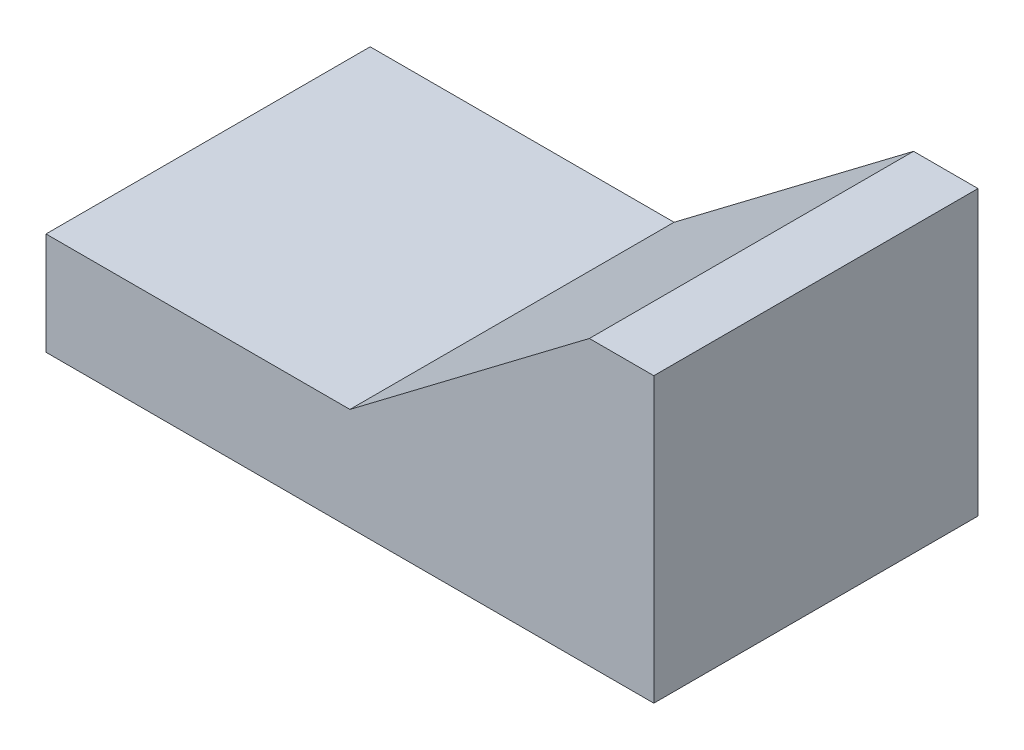
ISO-10303-21;
HEADER;
FILE_DESCRIPTION(('STEP AP214'),'2;1');
FILE_NAME('part.step','',(''),(''),'','','');
FILE_SCHEMA(('AUTOMOTIVE_DESIGN { 1 0 10303 214 1 1 1 1 }'));
ENDSEC;
DATA;
#1=APPLICATION_CONTEXT('core data for automotive mechanical design processes');
#2=APPLICATION_PROTOCOL_DEFINITION('international standard','automotive_design',2000,#1);
#3=PRODUCT_CONTEXT('',#1,'mechanical');
#4=PRODUCT('Part','Part','',(#3));
#5=PRODUCT_RELATED_PRODUCT_CATEGORY('part','',(#4));
#6=PRODUCT_DEFINITION_FORMATION('','',#4);
#7=PRODUCT_DEFINITION_CONTEXT('part definition',#1,'design');
#8=PRODUCT_DEFINITION('design','',#6,#7);
#9=PRODUCT_DEFINITION_SHAPE('','',#8);
#10=(LENGTH_UNIT() NAMED_UNIT(*) SI_UNIT(.MILLI.,.METRE.));
#11=(NAMED_UNIT(*) PLANE_ANGLE_UNIT() SI_UNIT($,.RADIAN.));
#12=(NAMED_UNIT(*) SI_UNIT($,.STERADIAN.) SOLID_ANGLE_UNIT());
#13=UNCERTAINTY_MEASURE_WITH_UNIT(LENGTH_MEASURE(1.E-05),#10,'distance_accuracy_value','');
#14=(GEOMETRIC_REPRESENTATION_CONTEXT(3) GLOBAL_UNCERTAINTY_ASSIGNED_CONTEXT((#13)) GLOBAL_UNIT_ASSIGNED_CONTEXT((#10,
#11,#12)) REPRESENTATION_CONTEXT('',''));
#15=CARTESIAN_POINT('',(0.,0.,0.));
#16=DIRECTION('',(0.,0.,1.));
#17=DIRECTION('',(1.,0.,0.));
#18=AXIS2_PLACEMENT_3D('',#15,#16,#17);
#19=CARTESIAN_POINT('',(-7.08514190317195,-1.5,8.));
#20=DIRECTION('',(1.,0.,0.));
#21=DIRECTION('',(0.,1.,0.));
#22=AXIS2_PLACEMENT_3D('',#19,#20,#21);
#23=PLANE('',#22);
#24=DIRECTION('',(0.,-1.,0.));
#25=VECTOR('',#24,1.);
#26=CARTESIAN_POINT('',(-7.08514190317195,-1.5,0.));
#27=LINE('',#26,#25);
#28=CARTESIAN_POINT('',(-7.08514190317195,1.02941176470588,0.));
#29=VERTEX_POINT('',#28);
#30=CARTESIAN_POINT('',(-7.08514190317195,-1.5,0.));
#31=VERTEX_POINT('',#30);
#32=EDGE_CURVE('E119',#29,#31,#27,.T.);
#33=ORIENTED_EDGE('',*,*,#32,.T.);
#34=DIRECTION('',(0.,0.,-1.));
#35=VECTOR('',#34,1.);
#36=CARTESIAN_POINT('',(-7.08514190317195,-1.5,8.));
#37=LINE('',#36,#35);
#38=CARTESIAN_POINT('',(-7.08514190317195,-1.5,8.));
#39=VERTEX_POINT('',#38);
#40=EDGE_CURVE('E11',#39,#31,#37,.T.);
#41=ORIENTED_EDGE('',*,*,#40,.F.);
#42=DIRECTION('',(0.,-1.,0.));
#43=VECTOR('',#42,1.);
#44=CARTESIAN_POINT('',(-7.08514190317195,-1.5,8.));
#45=LINE('',#44,#43);
#46=CARTESIAN_POINT('',(-7.08514190317195,1.02941176470588,8.));
#47=VERTEX_POINT('',#46);
#48=EDGE_CURVE('E129',#47,#39,#45,.T.);
#49=ORIENTED_EDGE('',*,*,#48,.F.);
#50=DIRECTION('',(0.,0.,-1.));
#51=VECTOR('',#50,1.);
#52=CARTESIAN_POINT('',(-7.08514190317195,1.02941176470588,8.));
#53=LINE('',#52,#51);
#54=EDGE_CURVE('E115',#47,#29,#53,.T.);
#55=ORIENTED_EDGE('',*,*,#54,.T.);
#56=EDGE_LOOP('',(#33,#41,#49,#55));
#57=FACE_BOUND('',#56,.T.);
#58=ADVANCED_FACE('F35',(#57),#23,.F.);
#59=CARTESIAN_POINT('',(-7.08514190317195,-1.5,8.));
#60=DIRECTION('',(0.,1.,0.));
#61=DIRECTION('',(0.,0.,1.));
#62=AXIS2_PLACEMENT_3D('',#59,#60,#61);
#63=PLANE('',#62);
#64=DIRECTION('',(1.,0.,0.));
#65=VECTOR('',#64,1.);
#66=CARTESIAN_POINT('',(-7.08514190317195,-1.5,0.));
#67=LINE('',#66,#65);
#68=CARTESIAN_POINT('',(7.91485809682805,-1.5,0.));
#69=VERTEX_POINT('',#68);
#70=EDGE_CURVE('E122',#31,#69,#67,.T.);
#71=ORIENTED_EDGE('',*,*,#70,.T.);
#72=DIRECTION('',(0.,0.,-1.));
#73=VECTOR('',#72,1.);
#74=CARTESIAN_POINT('',(7.91485809682805,-1.5,8.));
#75=LINE('',#74,#73);
#76=CARTESIAN_POINT('',(7.91485809682805,-1.5,8.));
#77=VERTEX_POINT('',#76);
#78=EDGE_CURVE('E43',#77,#69,#75,.T.);
#79=ORIENTED_EDGE('',*,*,#78,.F.);
#80=DIRECTION('',(1.,0.,0.));
#81=VECTOR('',#80,1.);
#82=CARTESIAN_POINT('',(-7.08514190317195,-1.5,8.));
#83=LINE('',#82,#81);
#84=EDGE_CURVE('E88',#39,#77,#83,.T.);
#85=ORIENTED_EDGE('',*,*,#84,.F.);
#86=ORIENTED_EDGE('',*,*,#40,.T.);
#87=EDGE_LOOP('',(#71,#79,#85,#86));
#88=FACE_BOUND('',#87,.T.);
#89=ADVANCED_FACE('F153',(#88),#63,.F.);
#90=CARTESIAN_POINT('',(7.91485809682805,-1.5,8.));
#91=DIRECTION('',(-1.,0.,0.));
#92=DIRECTION('',(0.,0.,1.));
#93=AXIS2_PLACEMENT_3D('',#90,#91,#92);
#94=PLANE('',#93);
#95=DIRECTION('',(0.,1.,0.));
#96=VECTOR('',#95,1.);
#97=CARTESIAN_POINT('',(7.91485809682805,-1.5,0.));
#98=LINE('',#97,#96);
#99=CARTESIAN_POINT('',(7.91485809682805,5.5,0.));
#100=VERTEX_POINT('',#99);
#101=EDGE_CURVE('E124',#69,#100,#98,.T.);
#102=ORIENTED_EDGE('',*,*,#101,.T.);
#103=DIRECTION('',(0.,0.,-1.));
#104=VECTOR('',#103,1.);
#105=CARTESIAN_POINT('',(7.91485809682805,5.5,8.));
#106=LINE('',#105,#104);
#107=CARTESIAN_POINT('',(7.91485809682805,5.5,8.));
#108=VERTEX_POINT('',#107);
#109=EDGE_CURVE('E110',#108,#100,#106,.T.);
#110=ORIENTED_EDGE('',*,*,#109,.F.);
#111=DIRECTION('',(0.,1.,0.));
#112=VECTOR('',#111,1.);
#113=CARTESIAN_POINT('',(7.91485809682805,-1.5,8.));
#114=LINE('',#113,#112);
#115=EDGE_CURVE('E101',#77,#108,#114,.T.);
#116=ORIENTED_EDGE('',*,*,#115,.F.);
#117=ORIENTED_EDGE('',*,*,#78,.T.);
#118=EDGE_LOOP('',(#102,#110,#116,#117));
#119=FACE_BOUND('',#118,.T.);
#120=ADVANCED_FACE('F135',(#119),#94,.F.);
#121=CARTESIAN_POINT('',(7.91485809682805,5.5,8.));
#122=DIRECTION('',(0.,-1.,0.));
#123=DIRECTION('',(0.,0.,-1.));
#124=AXIS2_PLACEMENT_3D('',#121,#122,#123);
#125=PLANE('',#124);
#126=DIRECTION('',(-1.,0.,0.));
#127=VECTOR('',#126,1.);
#128=CARTESIAN_POINT('',(7.91485809682805,5.5,0.));
#129=LINE('',#128,#127);
#130=CARTESIAN_POINT('',(6.3242183909457,5.5,0.));
#131=VERTEX_POINT('',#130);
#132=EDGE_CURVE('E109',#100,#131,#129,.T.);
#133=ORIENTED_EDGE('',*,*,#132,.T.);
#134=DIRECTION('',(0.,0.,-1.));
#135=VECTOR('',#134,1.);
#136=CARTESIAN_POINT('',(6.3242183909457,5.5,8.));
#137=LINE('',#136,#135);
#138=CARTESIAN_POINT('',(6.3242183909457,5.5,8.));
#139=VERTEX_POINT('',#138);
#140=EDGE_CURVE('E106',#139,#131,#137,.T.);
#141=ORIENTED_EDGE('',*,*,#140,.F.);
#142=DIRECTION('',(-1.,0.,0.));
#143=VECTOR('',#142,1.);
#144=CARTESIAN_POINT('',(7.91485809682805,5.5,8.));
#145=LINE('',#144,#143);
#146=EDGE_CURVE('E95',#108,#139,#145,.T.);
#147=ORIENTED_EDGE('',*,*,#146,.F.);
#148=ORIENTED_EDGE('',*,*,#109,.T.);
#149=EDGE_LOOP('',(#133,#141,#147,#148));
#150=FACE_BOUND('',#149,.T.);
#151=ADVANCED_FACE('F107',(#150),#125,.F.);
#152=CARTESIAN_POINT('',(6.3242183909457,5.5,8.));
#153=DIRECTION('',(0.603325951557647,-0.797494699779917,0.));
#154=DIRECTION('',(0.797494699779917,0.603325951557647,0.));
#155=AXIS2_PLACEMENT_3D('',#152,#153,#154);
#156=PLANE('',#155);
#157=DIRECTION('',(-0.797494699779916,-0.603325951557647,0.));
#158=VECTOR('',#157,1.);
#159=CARTESIAN_POINT('',(6.3242183909457,5.5,0.));
#160=LINE('',#159,#158);
#161=CARTESIAN_POINT('',(0.414858096828047,1.02941176470588,0.));
#162=VERTEX_POINT('',#161);
#163=EDGE_CURVE('E74',#131,#162,#160,.T.);
#164=ORIENTED_EDGE('',*,*,#163,.T.);
#165=DIRECTION('',(0.,0.,-1.));
#166=VECTOR('',#165,1.);
#167=CARTESIAN_POINT('',(0.414858096828047,1.02941176470588,8.));
#168=LINE('',#167,#166);
#169=CARTESIAN_POINT('',(0.414858096828047,1.02941176470588,8.));
#170=VERTEX_POINT('',#169);
#171=EDGE_CURVE('E111',#170,#162,#168,.T.);
#172=ORIENTED_EDGE('',*,*,#171,.F.);
#173=DIRECTION('',(-0.797494699779916,-0.603325951557647,0.));
#174=VECTOR('',#173,1.);
#175=CARTESIAN_POINT('',(6.3242183909457,5.5,8.));
#176=LINE('',#175,#174);
#177=EDGE_CURVE('E99',#139,#170,#176,.T.);
#178=ORIENTED_EDGE('',*,*,#177,.F.);
#179=ORIENTED_EDGE('',*,*,#140,.T.);
#180=EDGE_LOOP('',(#164,#172,#178,#179));
#181=FACE_BOUND('',#180,.T.);
#182=ADVANCED_FACE('F113',(#181),#156,.F.);
#183=CARTESIAN_POINT('',(-7.08514190317195,1.02941176470588,8.));
#184=DIRECTION('',(0.,-1.,0.));
#185=DIRECTION('',(0.,0.,-1.));
#186=AXIS2_PLACEMENT_3D('',#183,#184,#185);
#187=PLANE('',#186);
#188=DIRECTION('',(-1.,0.,0.));
#189=VECTOR('',#188,1.);
#190=CARTESIAN_POINT('',(-7.08514190317195,1.02941176470588,0.));
#191=LINE('',#190,#189);
#192=EDGE_CURVE('E80',#162,#29,#191,.T.);
#193=ORIENTED_EDGE('',*,*,#192,.T.);
#194=ORIENTED_EDGE('',*,*,#54,.F.);
#195=DIRECTION('',(-1.,0.,0.));
#196=VECTOR('',#195,1.);
#197=CARTESIAN_POINT('',(-7.08514190317195,1.02941176470588,8.));
#198=LINE('',#197,#196);
#199=EDGE_CURVE('E51',#170,#47,#198,.T.);
#200=ORIENTED_EDGE('',*,*,#199,.F.);
#201=ORIENTED_EDGE('',*,*,#171,.T.);
#202=EDGE_LOOP('',(#193,#194,#200,#201));
#203=FACE_BOUND('',#202,.T.);
#204=ADVANCED_FACE('F142',(#203),#187,.F.);
#205=CARTESIAN_POINT('',(0.,0.,8.));
#206=DIRECTION('',(0.,0.,-1.));
#207=DIRECTION('',(-1.,0.,0.));
#208=AXIS2_PLACEMENT_3D('',#205,#206,#207);
#209=PLANE('',#208);
#210=ORIENTED_EDGE('',*,*,#48,.T.);
#211=ORIENTED_EDGE('',*,*,#84,.T.);
#212=ORIENTED_EDGE('',*,*,#115,.T.);
#213=ORIENTED_EDGE('',*,*,#146,.T.);
#214=ORIENTED_EDGE('',*,*,#177,.T.);
#215=ORIENTED_EDGE('',*,*,#199,.T.);
#216=EDGE_LOOP('',(#210,#211,#212,#213,#214,#215));
#217=FACE_BOUND('',#216,.T.);
#218=ADVANCED_FACE('F97',(#217),#209,.F.);
#219=CARTESIAN_POINT('',(0.,0.,0.));
#220=DIRECTION('',(0.,0.,-1.));
#221=DIRECTION('',(-1.,0.,0.));
#222=AXIS2_PLACEMENT_3D('',#219,#220,#221);
#223=PLANE('',#222);
#224=ORIENTED_EDGE('',*,*,#32,.F.);
#225=ORIENTED_EDGE('',*,*,#192,.F.);
#226=ORIENTED_EDGE('',*,*,#163,.F.);
#227=ORIENTED_EDGE('',*,*,#132,.F.);
#228=ORIENTED_EDGE('',*,*,#101,.F.);
#229=ORIENTED_EDGE('',*,*,#70,.F.);
#230=EDGE_LOOP('',(#224,#225,#226,#227,#228,#229));
#231=FACE_BOUND('',#230,.T.);
#232=ADVANCED_FACE('F138',(#231),#223,.T.);
#233=CLOSED_SHELL('',(#58,#89,#120,#151,#182,#204,#218,#232));
#234=MANIFOLD_SOLID_BREP('B2',#233);
#235=ADVANCED_BREP_SHAPE_REPRESENTATION('',(#18,#234),#14);
#236=SHAPE_DEFINITION_REPRESENTATION(#9,#235);
ENDSEC;
END-ISO-10303-21;
